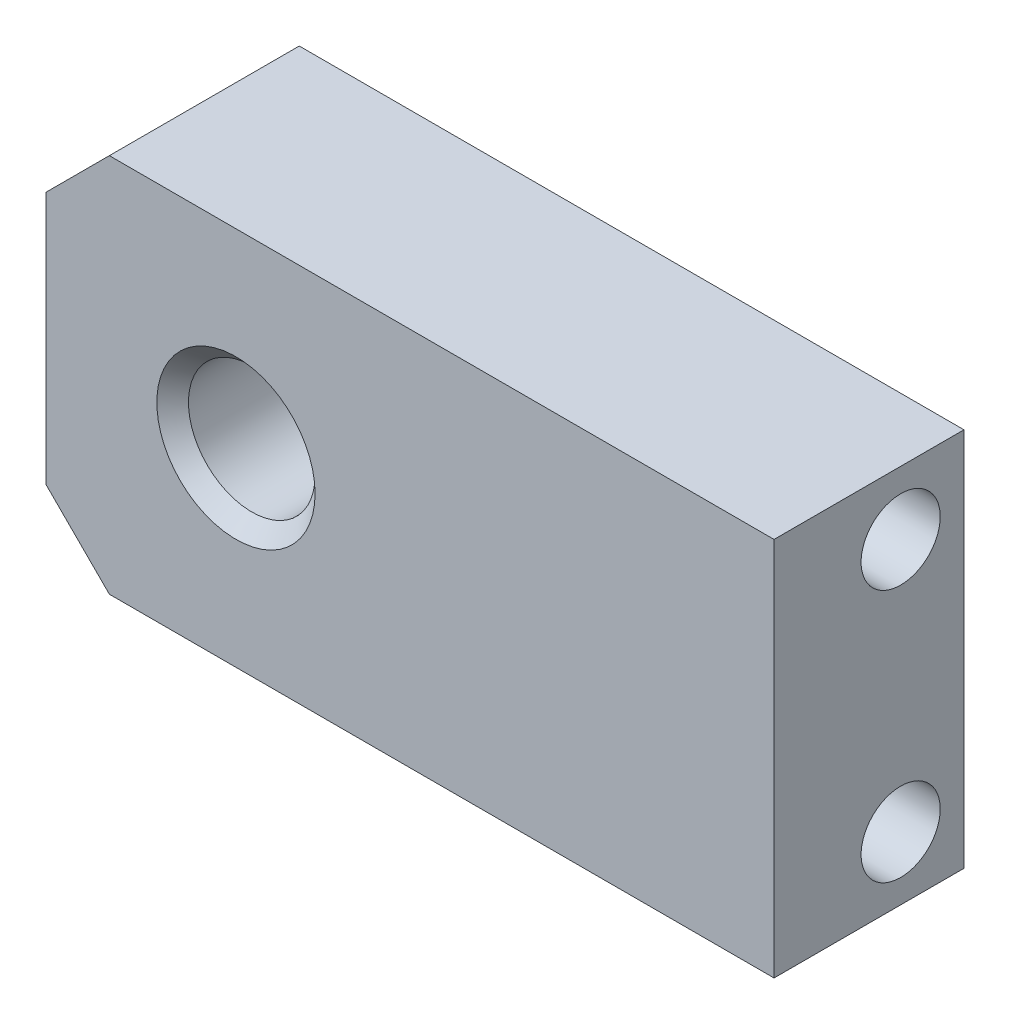
ISO-10303-21;
HEADER;
FILE_DESCRIPTION(('STEP AP214'),'2;1');
FILE_NAME('part.step','',(''),(''),'','','');
FILE_SCHEMA(('AUTOMOTIVE_DESIGN { 1 0 10303 214 1 1 1 1 }'));
ENDSEC;
DATA;
#1=APPLICATION_CONTEXT('core data for automotive mechanical design processes');
#2=APPLICATION_PROTOCOL_DEFINITION('international standard','automotive_design',2000,#1);
#3=PRODUCT_CONTEXT('',#1,'mechanical');
#4=PRODUCT('Part','Part','',(#3));
#5=PRODUCT_RELATED_PRODUCT_CATEGORY('part','',(#4));
#6=PRODUCT_DEFINITION_FORMATION('','',#4);
#7=PRODUCT_DEFINITION_CONTEXT('part definition',#1,'design');
#8=PRODUCT_DEFINITION('design','',#6,#7);
#9=PRODUCT_DEFINITION_SHAPE('','',#8);
#10=(LENGTH_UNIT() NAMED_UNIT(*) SI_UNIT(.MILLI.,.METRE.));
#11=(NAMED_UNIT(*) PLANE_ANGLE_UNIT() SI_UNIT($,.RADIAN.));
#12=(NAMED_UNIT(*) SI_UNIT($,.STERADIAN.) SOLID_ANGLE_UNIT());
#13=UNCERTAINTY_MEASURE_WITH_UNIT(LENGTH_MEASURE(1.E-05),#10,'distance_accuracy_value','');
#14=(GEOMETRIC_REPRESENTATION_CONTEXT(3) GLOBAL_UNCERTAINTY_ASSIGNED_CONTEXT((#13)) GLOBAL_UNIT_ASSIGNED_CONTEXT((#10,
#11,#12)) REPRESENTATION_CONTEXT('',''));
#15=CARTESIAN_POINT('',(0.,0.,0.));
#16=DIRECTION('',(0.,0.,1.));
#17=DIRECTION('',(1.,0.,0.));
#18=AXIS2_PLACEMENT_3D('',#15,#16,#17);
#19=CARTESIAN_POINT('',(0.,0.,6.));
#20=DIRECTION('',(0.,0.,1.));
#21=DIRECTION('',(1.,0.,0.));
#22=AXIS2_PLACEMENT_3D('',#19,#20,#21);
#23=PLANE('',#22);
#24=CARTESIAN_POINT('',(-5.5,0.,6.));
#25=DIRECTION('',(0.,0.,1.));
#26=DIRECTION('',(1.,0.,0.));
#27=AXIS2_PLACEMENT_3D('',#24,#25,#26);
#28=CIRCLE('',#27,2.49999999999999);
#29=CARTESIAN_POINT('',(-3.00000000000001,0.,6.));
#30=VERTEX_POINT('',#29);
#31=EDGE_CURVE('E11',#30,#30,#28,.F.);
#32=ORIENTED_EDGE('',*,*,#31,.T.);
#33=EDGE_LOOP('',(#32));
#34=FACE_BOUND('',#33,.T.);
#35=DIRECTION('',(0.,1.,0.));
#36=VECTOR('',#35,1.);
#37=CARTESIAN_POINT('',(11.5,6.,6.));
#38=LINE('',#37,#36);
#39=CARTESIAN_POINT('',(11.5,-6.,6.));
#40=VERTEX_POINT('',#39);
#41=CARTESIAN_POINT('',(11.5,6.,6.));
#42=VERTEX_POINT('',#41);
#43=EDGE_CURVE('E164',#40,#42,#38,.T.);
#44=ORIENTED_EDGE('',*,*,#43,.T.);
#45=DIRECTION('',(-1.,0.,0.));
#46=VECTOR('',#45,1.);
#47=CARTESIAN_POINT('',(-9.5,6.,6.));
#48=LINE('',#47,#46);
#49=CARTESIAN_POINT('',(-9.5,6.,6.));
#50=VERTEX_POINT('',#49);
#51=EDGE_CURVE('E111',#42,#50,#48,.T.);
#52=ORIENTED_EDGE('',*,*,#51,.T.);
#53=DIRECTION('',(-0.707106781186542,-0.707106781186553,0.));
#54=VECTOR('',#53,1.);
#55=CARTESIAN_POINT('',(-9.5,6.,6.));
#56=LINE('',#55,#54);
#57=CARTESIAN_POINT('',(-11.5,3.99999999999997,6.));
#58=VERTEX_POINT('',#57);
#59=EDGE_CURVE('E125',#50,#58,#56,.T.);
#60=ORIENTED_EDGE('',*,*,#59,.T.);
#61=DIRECTION('',(0.,-1.,0.));
#62=VECTOR('',#61,1.);
#63=CARTESIAN_POINT('',(-11.5,3.99999999999997,6.));
#64=LINE('',#63,#62);
#65=CARTESIAN_POINT('',(-11.5,-4.,6.));
#66=VERTEX_POINT('',#65);
#67=EDGE_CURVE('E120',#58,#66,#64,.T.);
#68=ORIENTED_EDGE('',*,*,#67,.T.);
#69=DIRECTION('',(0.707106781186547,-0.707106781186548,0.));
#70=VECTOR('',#69,1.);
#71=CARTESIAN_POINT('',(-9.5,-6.,6.));
#72=LINE('',#71,#70);
#73=CARTESIAN_POINT('',(-9.5,-6.,6.));
#74=VERTEX_POINT('',#73);
#75=EDGE_CURVE('E123',#66,#74,#72,.T.);
#76=ORIENTED_EDGE('',*,*,#75,.T.);
#77=DIRECTION('',(1.,0.,0.));
#78=VECTOR('',#77,1.);
#79=CARTESIAN_POINT('',(-9.5,-6.,6.));
#80=LINE('',#79,#78);
#81=EDGE_CURVE('E72',#74,#40,#80,.T.);
#82=ORIENTED_EDGE('',*,*,#81,.T.);
#83=EDGE_LOOP('',(#44,#52,#60,#68,#76,#82));
#84=FACE_BOUND('',#83,.T.);
#85=ADVANCED_FACE('F53',(#34,#84),#23,.T.);
#86=CARTESIAN_POINT('',(0.,0.,0.));
#87=DIRECTION('',(0.,0.,1.));
#88=DIRECTION('',(1.,0.,0.));
#89=AXIS2_PLACEMENT_3D('',#86,#87,#88);
#90=PLANE('',#89);
#91=CARTESIAN_POINT('',(-5.5,0.,0.));
#92=DIRECTION('',(0.,0.,1.));
#93=DIRECTION('',(1.,0.,0.));
#94=AXIS2_PLACEMENT_3D('',#91,#92,#93);
#95=CIRCLE('',#94,2.5);
#96=CARTESIAN_POINT('',(-3.,0.,0.));
#97=VERTEX_POINT('',#96);
#98=EDGE_CURVE('E178',#97,#97,#95,.T.);
#99=ORIENTED_EDGE('',*,*,#98,.T.);
#100=EDGE_LOOP('',(#99));
#101=FACE_BOUND('',#100,.T.);
#102=DIRECTION('',(0.,1.,0.));
#103=VECTOR('',#102,1.);
#104=CARTESIAN_POINT('',(11.5,6.,0.));
#105=LINE('',#104,#103);
#106=CARTESIAN_POINT('',(11.5,-6.,0.));
#107=VERTEX_POINT('',#106);
#108=CARTESIAN_POINT('',(11.5,6.,0.));
#109=VERTEX_POINT('',#108);
#110=EDGE_CURVE('E147',#107,#109,#105,.T.);
#111=ORIENTED_EDGE('',*,*,#110,.F.);
#112=DIRECTION('',(1.,0.,0.));
#113=VECTOR('',#112,1.);
#114=CARTESIAN_POINT('',(-9.5,-6.,0.));
#115=LINE('',#114,#113);
#116=CARTESIAN_POINT('',(-9.5,-6.,0.));
#117=VERTEX_POINT('',#116);
#118=EDGE_CURVE('E102',#117,#107,#115,.T.);
#119=ORIENTED_EDGE('',*,*,#118,.F.);
#120=DIRECTION('',(0.707106781186547,-0.707106781186548,0.));
#121=VECTOR('',#120,1.);
#122=CARTESIAN_POINT('',(-9.5,-6.,0.));
#123=LINE('',#122,#121);
#124=CARTESIAN_POINT('',(-11.5,-4.,0.));
#125=VERTEX_POINT('',#124);
#126=EDGE_CURVE('E96',#125,#117,#123,.T.);
#127=ORIENTED_EDGE('',*,*,#126,.F.);
#128=DIRECTION('',(0.,-1.,0.));
#129=VECTOR('',#128,1.);
#130=CARTESIAN_POINT('',(-11.5,3.99999999999997,0.));
#131=LINE('',#130,#129);
#132=CARTESIAN_POINT('',(-11.5,3.99999999999997,0.));
#133=VERTEX_POINT('',#132);
#134=EDGE_CURVE('E134',#133,#125,#131,.T.);
#135=ORIENTED_EDGE('',*,*,#134,.F.);
#136=DIRECTION('',(-0.707106781186542,-0.707106781186553,0.));
#137=VECTOR('',#136,1.);
#138=CARTESIAN_POINT('',(-9.5,6.,0.));
#139=LINE('',#138,#137);
#140=CARTESIAN_POINT('',(-9.5,6.,0.));
#141=VERTEX_POINT('',#140);
#142=EDGE_CURVE('E155',#141,#133,#139,.T.);
#143=ORIENTED_EDGE('',*,*,#142,.F.);
#144=DIRECTION('',(-1.,0.,0.));
#145=VECTOR('',#144,1.);
#146=CARTESIAN_POINT('',(-9.5,6.,0.));
#147=LINE('',#146,#145);
#148=EDGE_CURVE('E151',#109,#141,#147,.T.);
#149=ORIENTED_EDGE('',*,*,#148,.F.);
#150=EDGE_LOOP('',(#111,#119,#127,#135,#143,#149));
#151=FACE_BOUND('',#150,.T.);
#152=ADVANCED_FACE('F197',(#101,#151),#90,.F.);
#153=CARTESIAN_POINT('',(11.5,6.,6.));
#154=DIRECTION('',(-1.,0.,0.));
#155=DIRECTION('',(0.,0.,1.));
#156=AXIS2_PLACEMENT_3D('',#153,#154,#155);
#157=PLANE('',#156);
#158=CARTESIAN_POINT('',(11.5,4.,2.));
#159=DIRECTION('',(1.,0.,0.));
#160=DIRECTION('',(0.,0.,-1.));
#161=AXIS2_PLACEMENT_3D('',#158,#159,#160);
#162=CIRCLE('',#161,1.25);
#163=CARTESIAN_POINT('',(11.5,4.,0.750000000000001));
#164=VERTEX_POINT('',#163);
#165=EDGE_CURVE('E245',#164,#164,#162,.T.);
#166=ORIENTED_EDGE('',*,*,#165,.F.);
#167=EDGE_LOOP('',(#166));
#168=FACE_BOUND('',#167,.T.);
#169=CARTESIAN_POINT('',(11.5,-4.,2.));
#170=DIRECTION('',(1.,0.,0.));
#171=DIRECTION('',(0.,0.,-1.));
#172=AXIS2_PLACEMENT_3D('',#169,#170,#171);
#173=CIRCLE('',#172,1.25);
#174=CARTESIAN_POINT('',(11.5,-4.,0.750000000000001));
#175=VERTEX_POINT('',#174);
#176=EDGE_CURVE('E250',#175,#175,#173,.T.);
#177=ORIENTED_EDGE('',*,*,#176,.F.);
#178=EDGE_LOOP('',(#177));
#179=FACE_BOUND('',#178,.T.);
#180=ORIENTED_EDGE('',*,*,#110,.T.);
#181=DIRECTION('',(0.,0.,-1.));
#182=VECTOR('',#181,1.);
#183=CARTESIAN_POINT('',(11.5,6.,6.));
#184=LINE('',#183,#182);
#185=EDGE_CURVE('E175',#42,#109,#184,.T.);
#186=ORIENTED_EDGE('',*,*,#185,.F.);
#187=ORIENTED_EDGE('',*,*,#43,.F.);
#188=DIRECTION('',(0.,0.,-1.));
#189=VECTOR('',#188,1.);
#190=CARTESIAN_POINT('',(11.5,-6.,6.));
#191=LINE('',#190,#189);
#192=EDGE_CURVE('E143',#40,#107,#191,.T.);
#193=ORIENTED_EDGE('',*,*,#192,.T.);
#194=EDGE_LOOP('',(#180,#186,#187,#193));
#195=FACE_BOUND('',#194,.T.);
#196=ADVANCED_FACE('F200',(#168,#179,#195),#157,.F.);
#197=CARTESIAN_POINT('',(-9.5,6.,6.));
#198=DIRECTION('',(0.,-1.,0.));
#199=DIRECTION('',(0.,0.,-1.));
#200=AXIS2_PLACEMENT_3D('',#197,#198,#199);
#201=PLANE('',#200);
#202=ORIENTED_EDGE('',*,*,#148,.T.);
#203=DIRECTION('',(0.,0.,-1.));
#204=VECTOR('',#203,1.);
#205=CARTESIAN_POINT('',(-9.5,6.,6.));
#206=LINE('',#205,#204);
#207=EDGE_CURVE('E171',#50,#141,#206,.T.);
#208=ORIENTED_EDGE('',*,*,#207,.F.);
#209=ORIENTED_EDGE('',*,*,#51,.F.);
#210=ORIENTED_EDGE('',*,*,#185,.T.);
#211=EDGE_LOOP('',(#202,#208,#209,#210));
#212=FACE_BOUND('',#211,.T.);
#213=ADVANCED_FACE('F263',(#212),#201,.F.);
#214=CARTESIAN_POINT('',(-9.5,6.,6.));
#215=DIRECTION('',(0.707106781186553,-0.707106781186542,0.));
#216=DIRECTION('',(0.707106781186542,0.707106781186553,0.));
#217=AXIS2_PLACEMENT_3D('',#214,#215,#216);
#218=PLANE('',#217);
#219=ORIENTED_EDGE('',*,*,#142,.T.);
#220=DIRECTION('',(0.,0.,-1.));
#221=VECTOR('',#220,1.);
#222=CARTESIAN_POINT('',(-11.5,3.99999999999997,6.));
#223=LINE('',#222,#221);
#224=EDGE_CURVE('E136',#58,#133,#223,.T.);
#225=ORIENTED_EDGE('',*,*,#224,.F.);
#226=ORIENTED_EDGE('',*,*,#59,.F.);
#227=ORIENTED_EDGE('',*,*,#207,.T.);
#228=EDGE_LOOP('',(#219,#225,#226,#227));
#229=FACE_BOUND('',#228,.T.);
#230=ADVANCED_FACE('F265',(#229),#218,.F.);
#231=CARTESIAN_POINT('',(-11.5,3.99999999999997,6.));
#232=DIRECTION('',(1.,0.,0.));
#233=DIRECTION('',(0.,1.,0.));
#234=AXIS2_PLACEMENT_3D('',#231,#232,#233);
#235=PLANE('',#234);
#236=ORIENTED_EDGE('',*,*,#134,.T.);
#237=DIRECTION('',(0.,0.,-1.));
#238=VECTOR('',#237,1.);
#239=CARTESIAN_POINT('',(-11.5,-4.,6.));
#240=LINE('',#239,#238);
#241=EDGE_CURVE('E131',#66,#125,#240,.T.);
#242=ORIENTED_EDGE('',*,*,#241,.F.);
#243=ORIENTED_EDGE('',*,*,#67,.F.);
#244=ORIENTED_EDGE('',*,*,#224,.T.);
#245=EDGE_LOOP('',(#236,#242,#243,#244));
#246=FACE_BOUND('',#245,.T.);
#247=ADVANCED_FACE('F132',(#246),#235,.F.);
#248=CARTESIAN_POINT('',(-9.5,-6.,6.));
#249=DIRECTION('',(0.707106781186548,0.707106781186547,0.));
#250=DIRECTION('',(-0.707106781186547,0.707106781186548,0.));
#251=AXIS2_PLACEMENT_3D('',#248,#249,#250);
#252=PLANE('',#251);
#253=ORIENTED_EDGE('',*,*,#126,.T.);
#254=DIRECTION('',(0.,0.,-1.));
#255=VECTOR('',#254,1.);
#256=CARTESIAN_POINT('',(-9.5,-6.,6.));
#257=LINE('',#256,#255);
#258=EDGE_CURVE('E137',#74,#117,#257,.T.);
#259=ORIENTED_EDGE('',*,*,#258,.F.);
#260=ORIENTED_EDGE('',*,*,#75,.F.);
#261=ORIENTED_EDGE('',*,*,#241,.T.);
#262=EDGE_LOOP('',(#253,#259,#260,#261));
#263=FACE_BOUND('',#262,.T.);
#264=ADVANCED_FACE('F139',(#263),#252,.F.);
#265=CARTESIAN_POINT('',(-9.5,-6.,6.));
#266=DIRECTION('',(0.,1.,0.));
#267=DIRECTION('',(0.,0.,1.));
#268=AXIS2_PLACEMENT_3D('',#265,#266,#267);
#269=PLANE('',#268);
#270=ORIENTED_EDGE('',*,*,#118,.T.);
#271=ORIENTED_EDGE('',*,*,#192,.F.);
#272=ORIENTED_EDGE('',*,*,#81,.F.);
#273=ORIENTED_EDGE('',*,*,#258,.T.);
#274=EDGE_LOOP('',(#270,#271,#272,#273));
#275=FACE_BOUND('',#274,.T.);
#276=ADVANCED_FACE('F207',(#275),#269,.F.);
#277=CARTESIAN_POINT('',(-5.5,0.,6.));
#278=DIRECTION('',(0.,0.,-1.));
#279=DIRECTION('',(-1.,0.,0.));
#280=AXIS2_PLACEMENT_3D('',#277,#278,#279);
#281=CYLINDRICAL_SURFACE('',#280,2.);
#282=CARTESIAN_POINT('',(-5.5,0.,0.499999999999999));
#283=DIRECTION('',(0.,0.,1.));
#284=DIRECTION('',(1.,0.,0.));
#285=AXIS2_PLACEMENT_3D('',#282,#283,#284);
#286=CIRCLE('',#285,2.);
#287=CARTESIAN_POINT('',(-3.5,0.,0.499999999999999));
#288=VERTEX_POINT('',#287);
#289=EDGE_CURVE('E64',#288,#288,#286,.F.);
#290=ORIENTED_EDGE('',*,*,#289,.T.);
#291=EDGE_LOOP('',(#290));
#292=FACE_BOUND('',#291,.T.);
#293=CARTESIAN_POINT('',(-5.5,0.,5.50000000000001));
#294=DIRECTION('',(0.,0.,1.));
#295=DIRECTION('',(1.,0.,0.));
#296=AXIS2_PLACEMENT_3D('',#293,#294,#295);
#297=CIRCLE('',#296,2.);
#298=CARTESIAN_POINT('',(-3.5,0.,5.50000000000001));
#299=VERTEX_POINT('',#298);
#300=EDGE_CURVE('E182',#299,#299,#297,.T.);
#301=ORIENTED_EDGE('',*,*,#300,.T.);
#302=EDGE_LOOP('',(#301));
#303=FACE_BOUND('',#302,.T.);
#304=ADVANCED_FACE('F189',(#292,#303),#281,.F.);
#305=CARTESIAN_POINT('',(-5.5,0.,0.));
#306=DIRECTION('',(0.,0.,-1.));
#307=DIRECTION('',(-1.,0.,0.));
#308=AXIS2_PLACEMENT_3D('',#305,#306,#307);
#309=CONICAL_SURFACE('',#308,2.5,0.785398163397448);
#310=ORIENTED_EDGE('',*,*,#289,.F.);
#311=EDGE_LOOP('',(#310));
#312=FACE_BOUND('',#311,.T.);
#313=ORIENTED_EDGE('',*,*,#98,.F.);
#314=EDGE_LOOP('',(#313));
#315=FACE_BOUND('',#314,.T.);
#316=ADVANCED_FACE('F192',(#312,#315),#309,.F.);
#317=CARTESIAN_POINT('',(-5.5,0.,5.50000000000001));
#318=DIRECTION('',(0.,0.,1.));
#319=DIRECTION('',(1.,0.,0.));
#320=AXIS2_PLACEMENT_3D('',#317,#318,#319);
#321=CONICAL_SURFACE('',#320,2.,0.785398163397448);
#322=ORIENTED_EDGE('',*,*,#31,.F.);
#323=EDGE_LOOP('',(#322));
#324=FACE_BOUND('',#323,.T.);
#325=ORIENTED_EDGE('',*,*,#300,.F.);
#326=EDGE_LOOP('',(#325));
#327=FACE_BOUND('',#326,.T.);
#328=ADVANCED_FACE('F56',(#324,#327),#321,.F.);
#329=CARTESIAN_POINT('',(1.5,-4.,2.));
#330=DIRECTION('',(1.,0.,0.));
#331=DIRECTION('',(0.,0.,-1.));
#332=AXIS2_PLACEMENT_3D('',#329,#330,#331);
#333=CONICAL_SURFACE('',#332,1.25,1.02974425867665);
#334=CARTESIAN_POINT('',(0.748924226215548,-4.,2.));
#335=VERTEX_POINT('',#334);
#336=VERTEX_LOOP('',#335);
#337=FACE_BOUND('',#336,.T.);
#338=CARTESIAN_POINT('',(1.5,-4.,2.));
#339=DIRECTION('',(1.,0.,0.));
#340=DIRECTION('',(0.,0.,-1.));
#341=AXIS2_PLACEMENT_3D('',#338,#339,#340);
#342=CIRCLE('',#341,1.25);
#343=CARTESIAN_POINT('',(1.5,-4.,0.750000000000002));
#344=VERTEX_POINT('',#343);
#345=EDGE_CURVE('E152',#344,#344,#342,.T.);
#346=ORIENTED_EDGE('',*,*,#345,.T.);
#347=EDGE_LOOP('',(#346));
#348=FACE_BOUND('',#347,.T.);
#349=ADVANCED_FACE('F222',(#337,#348),#333,.F.);
#350=CARTESIAN_POINT('',(11.5,-4.,2.));
#351=DIRECTION('',(1.,0.,0.));
#352=DIRECTION('',(0.,0.,-1.));
#353=AXIS2_PLACEMENT_3D('',#350,#351,#352);
#354=CYLINDRICAL_SURFACE('',#353,1.25);
#355=ORIENTED_EDGE('',*,*,#345,.F.);
#356=EDGE_LOOP('',(#355));
#357=FACE_BOUND('',#356,.T.);
#358=ORIENTED_EDGE('',*,*,#176,.T.);
#359=EDGE_LOOP('',(#358));
#360=FACE_BOUND('',#359,.T.);
#361=ADVANCED_FACE('F225',(#357,#360),#354,.F.);
#362=CARTESIAN_POINT('',(1.5,4.,2.));
#363=DIRECTION('',(1.,0.,0.));
#364=DIRECTION('',(0.,0.,-1.));
#365=AXIS2_PLACEMENT_3D('',#362,#363,#364);
#366=CONICAL_SURFACE('',#365,1.25,1.02974425867665);
#367=CARTESIAN_POINT('',(0.748924226215548,4.,2.));
#368=VERTEX_POINT('',#367);
#369=VERTEX_LOOP('',#368);
#370=FACE_BOUND('',#369,.T.);
#371=CARTESIAN_POINT('',(1.5,4.,2.));
#372=DIRECTION('',(1.,0.,0.));
#373=DIRECTION('',(0.,0.,-1.));
#374=AXIS2_PLACEMENT_3D('',#371,#372,#373);
#375=CIRCLE('',#374,1.25);
#376=CARTESIAN_POINT('',(1.5,4.,0.750000000000002));
#377=VERTEX_POINT('',#376);
#378=EDGE_CURVE('E242',#377,#377,#375,.T.);
#379=ORIENTED_EDGE('',*,*,#378,.T.);
#380=EDGE_LOOP('',(#379));
#381=FACE_BOUND('',#380,.T.);
#382=ADVANCED_FACE('F229',(#370,#381),#366,.F.);
#383=CARTESIAN_POINT('',(11.5,4.,2.));
#384=DIRECTION('',(1.,0.,0.));
#385=DIRECTION('',(0.,0.,-1.));
#386=AXIS2_PLACEMENT_3D('',#383,#384,#385);
#387=CYLINDRICAL_SURFACE('',#386,1.25);
#388=ORIENTED_EDGE('',*,*,#378,.F.);
#389=EDGE_LOOP('',(#388));
#390=FACE_BOUND('',#389,.T.);
#391=ORIENTED_EDGE('',*,*,#165,.T.);
#392=EDGE_LOOP('',(#391));
#393=FACE_BOUND('',#392,.T.);
#394=ADVANCED_FACE('F233',(#390,#393),#387,.F.);
#395=CLOSED_SHELL('',(#85,#152,#196,#213,#230,#247,#264,#276,#304,#316,#328,#349,#361,#382,#394));
#396=MANIFOLD_SOLID_BREP('B2',#395);
#397=ADVANCED_BREP_SHAPE_REPRESENTATION('',(#18,#396),#14);
#398=SHAPE_DEFINITION_REPRESENTATION(#9,#397);
ENDSEC;
END-ISO-10303-21;
